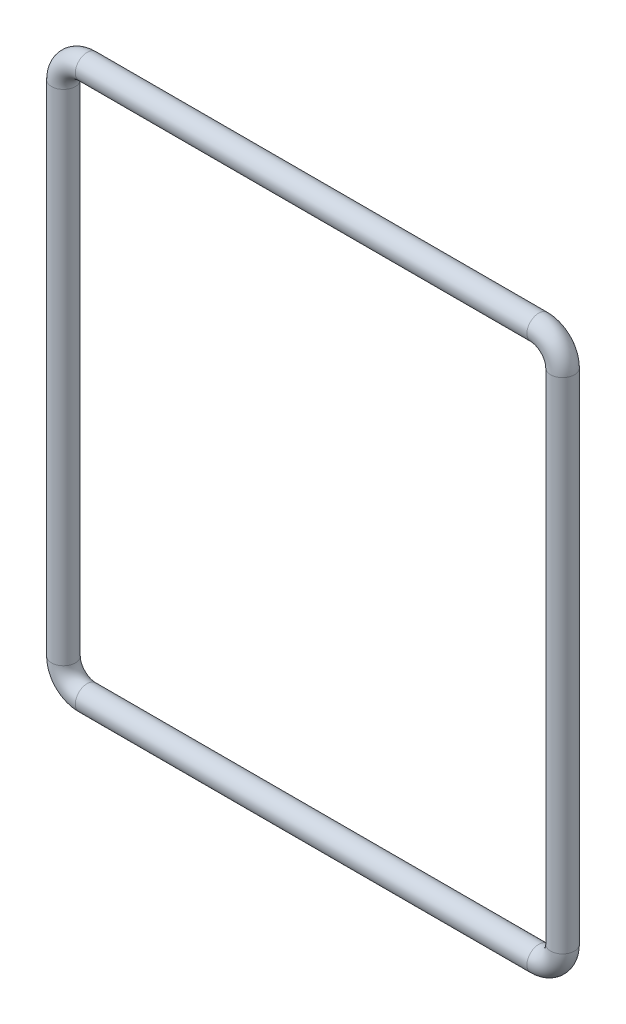
ISO-10303-21;
HEADER;
FILE_DESCRIPTION(('STEP AP214'),'2;1');
FILE_NAME('part.step','',(''),(''),'','','');
FILE_SCHEMA(('AUTOMOTIVE_DESIGN { 1 0 10303 214 1 1 1 1 }'));
ENDSEC;
DATA;
#1=APPLICATION_CONTEXT('core data for automotive mechanical design processes');
#2=APPLICATION_PROTOCOL_DEFINITION('international standard','automotive_design',2000,#1);
#3=PRODUCT_CONTEXT('',#1,'mechanical');
#4=PRODUCT('Part','Part','',(#3));
#5=PRODUCT_RELATED_PRODUCT_CATEGORY('part','',(#4));
#6=PRODUCT_DEFINITION_FORMATION('','',#4);
#7=PRODUCT_DEFINITION_CONTEXT('part definition',#1,'design');
#8=PRODUCT_DEFINITION('design','',#6,#7);
#9=PRODUCT_DEFINITION_SHAPE('','',#8);
#10=(LENGTH_UNIT() NAMED_UNIT(*) SI_UNIT(.MILLI.,.METRE.));
#11=(NAMED_UNIT(*) PLANE_ANGLE_UNIT() SI_UNIT($,.RADIAN.));
#12=(NAMED_UNIT(*) SI_UNIT($,.STERADIAN.) SOLID_ANGLE_UNIT());
#13=UNCERTAINTY_MEASURE_WITH_UNIT(LENGTH_MEASURE(1.E-05),#10,'distance_accuracy_value','');
#14=(GEOMETRIC_REPRESENTATION_CONTEXT(3) GLOBAL_UNCERTAINTY_ASSIGNED_CONTEXT((#13)) GLOBAL_UNIT_ASSIGNED_CONTEXT((#10,
#11,#12)) REPRESENTATION_CONTEXT('',''));
#15=CARTESIAN_POINT('',(0.,0.,0.));
#16=DIRECTION('',(0.,0.,1.));
#17=DIRECTION('',(1.,0.,0.));
#18=AXIS2_PLACEMENT_3D('',#15,#16,#17);
#19=CARTESIAN_POINT('',(19.,21.,0.));
#20=DIRECTION('',(0.,0.,-1.));
#21=DIRECTION('',(-1.,0.,0.));
#22=AXIS2_PLACEMENT_3D('',#19,#20,#21);
#23=TOROIDAL_SURFACE('',#22,2.,0.999999999999998);
#24=CARTESIAN_POINT('',(19.,23.,0.));
#25=DIRECTION('',(-1.,0.,0.));
#26=DIRECTION('',(0.,0.,1.));
#27=AXIS2_PLACEMENT_3D('',#24,#25,#26);
#28=CIRCLE('',#27,0.999999999999998);
#29=CARTESIAN_POINT('',(19.,24.,0.));
#30=VERTEX_POINT('',#29);
#31=EDGE_CURVE('E36',#30,#30,#28,.T.);
#32=CARTESIAN_POINT('',(21.,21.,0.));
#33=DIRECTION('',(0.,1.,0.));
#34=DIRECTION('',(0.,0.,1.));
#35=AXIS2_PLACEMENT_3D('',#32,#33,#34);
#36=CIRCLE('',#35,0.999999999999998);
#37=CARTESIAN_POINT('',(22.,21.,0.));
#38=VERTEX_POINT('',#37);
#39=EDGE_CURVE('E10',#38,#38,#36,.T.);
#40=CARTESIAN_POINT('',(19.,21.,0.));
#41=DIRECTION('',(0.,0.,-1.));
#42=DIRECTION('',(-1.,0.,0.));
#43=AXIS2_PLACEMENT_3D('',#40,#41,#42);
#44=CIRCLE('',#43,3.);
#45=EDGE_CURVE('',#30,#38,#44,.T.);
#46=ORIENTED_EDGE('',*,*,#31,.F.);
#47=ORIENTED_EDGE('',*,*,#39,.T.);
#48=ORIENTED_EDGE('',*,*,#45,.T.);
#49=ORIENTED_EDGE('',*,*,#45,.F.);
#50=EDGE_LOOP('',(#46,#48,#47,#49));
#51=FACE_BOUND('',#50,.T.);
#52=ADVANCED_FACE('F30',(#51),#23,.T.);
#53=CARTESIAN_POINT('',(-19.,23.,0.));
#54=DIRECTION('',(1.,0.,0.));
#55=DIRECTION('',(0.,0.,-1.));
#56=AXIS2_PLACEMENT_3D('',#53,#54,#55);
#57=CYLINDRICAL_SURFACE('',#56,0.999999999999998);
#58=CARTESIAN_POINT('',(-19.,23.,0.));
#59=DIRECTION('',(-1.,0.,0.));
#60=DIRECTION('',(0.,0.,1.));
#61=AXIS2_PLACEMENT_3D('',#58,#59,#60);
#62=CIRCLE('',#61,0.999999999999998);
#63=CARTESIAN_POINT('',(-19.,24.,0.));
#64=VERTEX_POINT('',#63);
#65=EDGE_CURVE('E40',#64,#64,#62,.T.);
#66=ORIENTED_EDGE('',*,*,#65,.F.);
#67=EDGE_LOOP('',(#66));
#68=FACE_BOUND('',#67,.T.);
#69=ORIENTED_EDGE('',*,*,#31,.T.);
#70=EDGE_LOOP('',(#69));
#71=FACE_BOUND('',#70,.T.);
#72=ADVANCED_FACE('F92',(#68,#71),#57,.T.);
#73=CARTESIAN_POINT('',(-19.,21.,0.));
#74=DIRECTION('',(0.,0.,-1.));
#75=DIRECTION('',(-1.,0.,0.));
#76=AXIS2_PLACEMENT_3D('',#73,#74,#75);
#77=TOROIDAL_SURFACE('',#76,2.,0.999999999999998);
#78=CARTESIAN_POINT('',(-21.,21.,0.));
#79=DIRECTION('',(0.,-1.,0.));
#80=DIRECTION('',(0.,0.,1.));
#81=AXIS2_PLACEMENT_3D('',#78,#79,#80);
#82=CIRCLE('',#81,0.999999999999998);
#83=CARTESIAN_POINT('',(-22.,21.,0.));
#84=VERTEX_POINT('',#83);
#85=EDGE_CURVE('E44',#84,#84,#82,.T.);
#86=CARTESIAN_POINT('',(-19.,21.,0.));
#87=DIRECTION('',(0.,0.,-1.));
#88=DIRECTION('',(-1.,0.,0.));
#89=AXIS2_PLACEMENT_3D('',#86,#87,#88);
#90=CIRCLE('',#89,3.);
#91=EDGE_CURVE('',#84,#64,#90,.T.);
#92=ORIENTED_EDGE('',*,*,#85,.F.);
#93=ORIENTED_EDGE('',*,*,#65,.T.);
#94=ORIENTED_EDGE('',*,*,#91,.T.);
#95=ORIENTED_EDGE('',*,*,#91,.F.);
#96=EDGE_LOOP('',(#92,#94,#93,#95));
#97=FACE_BOUND('',#96,.T.);
#98=ADVANCED_FACE('F86',(#97),#77,.T.);
#99=CARTESIAN_POINT('',(-21.,-21.,0.));
#100=DIRECTION('',(0.,1.,0.));
#101=DIRECTION('',(-1.,0.,0.));
#102=AXIS2_PLACEMENT_3D('',#99,#100,#101);
#103=CYLINDRICAL_SURFACE('',#102,0.999999999999998);
#104=CARTESIAN_POINT('',(-21.,-21.,0.));
#105=DIRECTION('',(0.,-1.,0.));
#106=DIRECTION('',(0.,0.,1.));
#107=AXIS2_PLACEMENT_3D('',#104,#105,#106);
#108=CIRCLE('',#107,0.999999999999998);
#109=CARTESIAN_POINT('',(-22.,-21.,0.));
#110=VERTEX_POINT('',#109);
#111=EDGE_CURVE('E49',#110,#110,#108,.T.);
#112=ORIENTED_EDGE('',*,*,#111,.F.);
#113=EDGE_LOOP('',(#112));
#114=FACE_BOUND('',#113,.T.);
#115=ORIENTED_EDGE('',*,*,#85,.T.);
#116=EDGE_LOOP('',(#115));
#117=FACE_BOUND('',#116,.T.);
#118=ADVANCED_FACE('F80',(#114,#117),#103,.T.);
#119=CARTESIAN_POINT('',(-19.,-21.,0.));
#120=DIRECTION('',(0.,0.,-1.));
#121=DIRECTION('',(-1.,0.,0.));
#122=AXIS2_PLACEMENT_3D('',#119,#120,#121);
#123=TOROIDAL_SURFACE('',#122,2.,0.999999999999998);
#124=CARTESIAN_POINT('',(-19.,-23.,0.));
#125=DIRECTION('',(1.,0.,0.));
#126=DIRECTION('',(0.,0.,1.));
#127=AXIS2_PLACEMENT_3D('',#124,#125,#126);
#128=CIRCLE('',#127,0.999999999999998);
#129=CARTESIAN_POINT('',(-19.,-24.,0.));
#130=VERTEX_POINT('',#129);
#131=EDGE_CURVE('E52',#130,#130,#128,.T.);
#132=CARTESIAN_POINT('',(-19.,-21.,0.));
#133=DIRECTION('',(0.,0.,-1.));
#134=DIRECTION('',(-1.,0.,0.));
#135=AXIS2_PLACEMENT_3D('',#132,#133,#134);
#136=CIRCLE('',#135,3.);
#137=EDGE_CURVE('',#130,#110,#136,.T.);
#138=ORIENTED_EDGE('',*,*,#131,.F.);
#139=ORIENTED_EDGE('',*,*,#111,.T.);
#140=ORIENTED_EDGE('',*,*,#137,.T.);
#141=ORIENTED_EDGE('',*,*,#137,.F.);
#142=EDGE_LOOP('',(#138,#140,#139,#141));
#143=FACE_BOUND('',#142,.T.);
#144=ADVANCED_FACE('F74',(#143),#123,.T.);
#145=CARTESIAN_POINT('',(19.,-23.,0.));
#146=DIRECTION('',(-1.,0.,0.));
#147=DIRECTION('',(0.,-1.,0.));
#148=AXIS2_PLACEMENT_3D('',#145,#146,#147);
#149=CYLINDRICAL_SURFACE('',#148,0.999999999999998);
#150=CARTESIAN_POINT('',(19.,-23.,0.));
#151=DIRECTION('',(1.,0.,0.));
#152=DIRECTION('',(0.,0.,1.));
#153=AXIS2_PLACEMENT_3D('',#150,#151,#152);
#154=CIRCLE('',#153,0.999999999999998);
#155=CARTESIAN_POINT('',(19.,-24.,0.));
#156=VERTEX_POINT('',#155);
#157=EDGE_CURVE('E55',#156,#156,#154,.T.);
#158=ORIENTED_EDGE('',*,*,#157,.F.);
#159=EDGE_LOOP('',(#158));
#160=FACE_BOUND('',#159,.T.);
#161=ORIENTED_EDGE('',*,*,#131,.T.);
#162=EDGE_LOOP('',(#161));
#163=FACE_BOUND('',#162,.T.);
#164=ADVANCED_FACE('F68',(#160,#163),#149,.T.);
#165=CARTESIAN_POINT('',(19.,-21.,0.));
#166=DIRECTION('',(0.,0.,-1.));
#167=DIRECTION('',(-1.,0.,0.));
#168=AXIS2_PLACEMENT_3D('',#165,#166,#167);
#169=TOROIDAL_SURFACE('',#168,1.99999999999999,0.999999999999998);
#170=CARTESIAN_POINT('',(21.,-21.,0.));
#171=DIRECTION('',(0.,1.,0.));
#172=DIRECTION('',(0.,0.,1.));
#173=AXIS2_PLACEMENT_3D('',#170,#171,#172);
#174=CIRCLE('',#173,0.999999999999998);
#175=CARTESIAN_POINT('',(22.,-21.,0.));
#176=VERTEX_POINT('',#175);
#177=EDGE_CURVE('E58',#176,#176,#174,.T.);
#178=CARTESIAN_POINT('',(19.,-21.,0.));
#179=DIRECTION('',(0.,0.,-1.));
#180=DIRECTION('',(-1.,0.,0.));
#181=AXIS2_PLACEMENT_3D('',#178,#179,#180);
#182=CIRCLE('',#181,2.99999999999999);
#183=EDGE_CURVE('',#176,#156,#182,.T.);
#184=ORIENTED_EDGE('',*,*,#177,.F.);
#185=ORIENTED_EDGE('',*,*,#157,.T.);
#186=ORIENTED_EDGE('',*,*,#183,.T.);
#187=ORIENTED_EDGE('',*,*,#183,.F.);
#188=EDGE_LOOP('',(#184,#186,#185,#187));
#189=FACE_BOUND('',#188,.T.);
#190=ADVANCED_FACE('F65',(#189),#169,.T.);
#191=CARTESIAN_POINT('',(21.,-21.,0.));
#192=DIRECTION('',(0.,1.,0.));
#193=DIRECTION('',(-1.,0.,0.));
#194=AXIS2_PLACEMENT_3D('',#191,#192,#193);
#195=CYLINDRICAL_SURFACE('',#194,0.999999999999998);
#196=ORIENTED_EDGE('',*,*,#177,.T.);
#197=EDGE_LOOP('',(#196));
#198=FACE_BOUND('',#197,.T.);
#199=ORIENTED_EDGE('',*,*,#39,.F.);
#200=EDGE_LOOP('',(#199));
#201=FACE_BOUND('',#200,.T.);
#202=ADVANCED_FACE('F62',(#198,#201),#195,.T.);
#203=CLOSED_SHELL('',(#52,#72,#98,#118,#144,#164,#190,#202));
#204=MANIFOLD_SOLID_BREP('B2',#203);
#205=ADVANCED_BREP_SHAPE_REPRESENTATION('',(#18,#204),#14);
#206=SHAPE_DEFINITION_REPRESENTATION(#9,#205);
ENDSEC;
END-ISO-10303-21;
